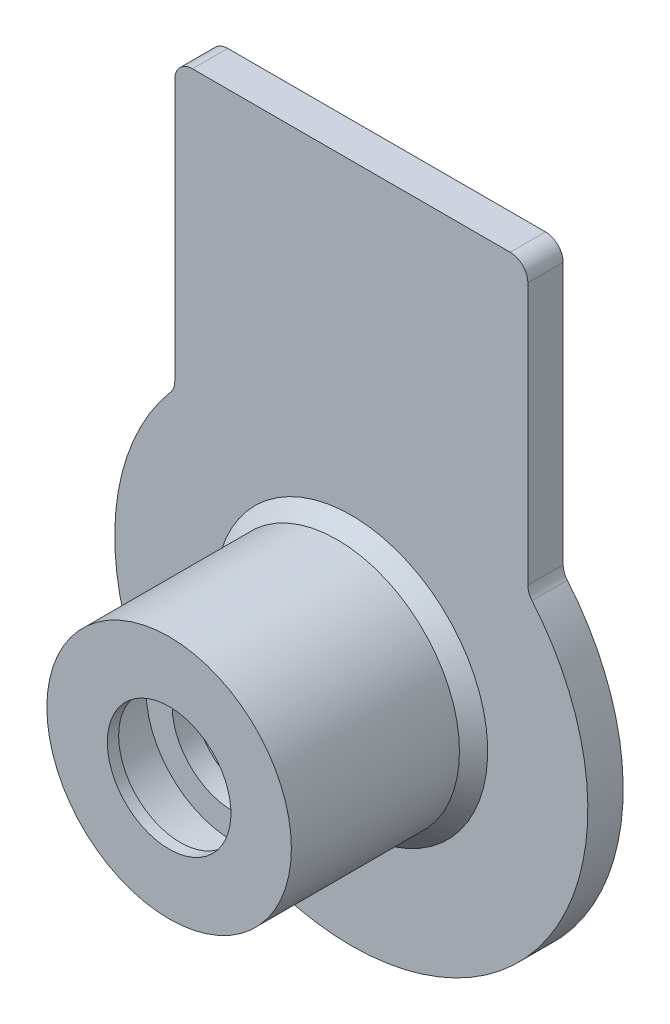
ISO-10303-21;
HEADER;
FILE_DESCRIPTION(('STEP AP214'),'2;1');
FILE_NAME('part.step','',(''),(''),'','','');
FILE_SCHEMA(('AUTOMOTIVE_DESIGN { 1 0 10303 214 1 1 1 1 }'));
ENDSEC;
DATA;
#1=APPLICATION_CONTEXT('core data for automotive mechanical design processes');
#2=APPLICATION_PROTOCOL_DEFINITION('international standard','automotive_design',2000,#1);
#3=PRODUCT_CONTEXT('',#1,'mechanical');
#4=PRODUCT('Part','Part','',(#3));
#5=PRODUCT_RELATED_PRODUCT_CATEGORY('part','',(#4));
#6=PRODUCT_DEFINITION_FORMATION('','',#4);
#7=PRODUCT_DEFINITION_CONTEXT('part definition',#1,'design');
#8=PRODUCT_DEFINITION('design','',#6,#7);
#9=PRODUCT_DEFINITION_SHAPE('','',#8);
#10=(LENGTH_UNIT() NAMED_UNIT(*) SI_UNIT(.MILLI.,.METRE.));
#11=(NAMED_UNIT(*) PLANE_ANGLE_UNIT() SI_UNIT($,.RADIAN.));
#12=(NAMED_UNIT(*) SI_UNIT($,.STERADIAN.) SOLID_ANGLE_UNIT());
#13=UNCERTAINTY_MEASURE_WITH_UNIT(LENGTH_MEASURE(1.E-05),#10,'distance_accuracy_value','');
#14=(GEOMETRIC_REPRESENTATION_CONTEXT(3) GLOBAL_UNCERTAINTY_ASSIGNED_CONTEXT((#13)) GLOBAL_UNIT_ASSIGNED_CONTEXT((#10,
#11,#12)) REPRESENTATION_CONTEXT('',''));
#15=CARTESIAN_POINT('',(0.,0.,0.));
#16=DIRECTION('',(0.,0.,1.));
#17=DIRECTION('',(1.,0.,0.));
#18=AXIS2_PLACEMENT_3D('',#15,#16,#17);
#19=CARTESIAN_POINT('',(-3.5,0.,12.32));
#20=DIRECTION('',(0.,0.,1.));
#21=DIRECTION('',(1.,0.,0.));
#22=AXIS2_PLACEMENT_3D('',#19,#20,#21);
#23=PLANE('',#22);
#24=CARTESIAN_POINT('',(0.,0.,12.32));
#25=DIRECTION('',(0.,0.,-1.));
#26=DIRECTION('',(-1.,0.,0.));
#27=AXIS2_PLACEMENT_3D('',#24,#25,#26);
#28=CIRCLE('',#27,3.5);
#29=CARTESIAN_POINT('',(-3.5,0.,12.32));
#30=VERTEX_POINT('',#29);
#31=EDGE_CURVE('E216',#30,#30,#28,.T.);
#32=ORIENTED_EDGE('',*,*,#31,.T.);
#33=EDGE_LOOP('',(#32));
#34=FACE_BOUND('',#33,.T.);
#35=CARTESIAN_POINT('',(0.,0.,12.32));
#36=DIRECTION('',(0.,0.,-1.));
#37=DIRECTION('',(-1.,0.,0.));
#38=AXIS2_PLACEMENT_3D('',#35,#36,#37);
#39=CIRCLE('',#38,6.925);
#40=CARTESIAN_POINT('',(-6.925,0.,12.32));
#41=VERTEX_POINT('',#40);
#42=EDGE_CURVE('E134',#41,#41,#39,.T.);
#43=ORIENTED_EDGE('',*,*,#42,.F.);
#44=EDGE_LOOP('',(#43));
#45=FACE_BOUND('',#44,.T.);
#46=ADVANCED_FACE('F40',(#34,#45),#23,.T.);
#47=CARTESIAN_POINT('',(0.,0.,0.));
#48=DIRECTION('',(0.,0.,-1.));
#49=DIRECTION('',(-1.,0.,0.));
#50=AXIS2_PLACEMENT_3D('',#47,#48,#49);
#51=CYLINDRICAL_SURFACE('',#50,6.925);
#52=CARTESIAN_POINT('',(0.,0.,2.8));
#53=DIRECTION('',(0.,0.,1.));
#54=DIRECTION('',(1.,0.,0.));
#55=AXIS2_PLACEMENT_3D('',#52,#53,#54);
#56=CIRCLE('',#55,6.925);
#57=CARTESIAN_POINT('',(-6.925,0.,2.8));
#58=VERTEX_POINT('',#57);
#59=EDGE_CURVE('E11',#58,#58,#56,.T.);
#60=ORIENTED_EDGE('',*,*,#59,.T.);
#61=EDGE_LOOP('',(#60));
#62=FACE_BOUND('',#61,.T.);
#63=ORIENTED_EDGE('',*,*,#42,.T.);
#64=EDGE_LOOP('',(#63));
#65=FACE_BOUND('',#64,.T.);
#66=ADVANCED_FACE('F178',(#62,#65),#51,.T.);
#67=CARTESIAN_POINT('',(-13.4,0.,2.));
#68=DIRECTION('',(0.,0.,1.));
#69=DIRECTION('',(1.,0.,0.));
#70=AXIS2_PLACEMENT_3D('',#67,#68,#69);
#71=PLANE('',#70);
#72=CARTESIAN_POINT('',(0.,0.,2.));
#73=DIRECTION('',(0.,0.,1.));
#74=DIRECTION('',(1.,0.,0.));
#75=AXIS2_PLACEMENT_3D('',#72,#73,#74);
#76=CIRCLE('',#75,7.725);
#77=CARTESIAN_POINT('',(-7.725,0.,2.));
#78=VERTEX_POINT('',#77);
#79=EDGE_CURVE('E49',#78,#78,#76,.F.);
#80=ORIENTED_EDGE('',*,*,#79,.T.);
#81=EDGE_LOOP('',(#80));
#82=FACE_BOUND('',#81,.T.);
#83=DIRECTION('',(0.,1.,0.));
#84=VECTOR('',#83,1.);
#85=CARTESIAN_POINT('',(10.,8.9196412483911,2.));
#86=LINE('',#85,#84);
#87=CARTESIAN_POINT('',(10.,9.29300812439116,2.));
#88=VERTEX_POINT('',#87);
#89=CARTESIAN_POINT('',(10.,24.1215762016988,2.));
#90=VERTEX_POINT('',#89);
#91=EDGE_CURVE('E211',#88,#90,#86,.T.);
#92=ORIENTED_EDGE('',*,*,#91,.T.);
#93=CARTESIAN_POINT('',(9.,24.1215762016988,2.));
#94=DIRECTION('',(0.,0.,1.));
#95=DIRECTION('',(1.,0.,0.));
#96=AXIS2_PLACEMENT_3D('',#93,#94,#95);
#97=CIRCLE('',#96,1.);
#98=CARTESIAN_POINT('',(9.,25.1215762016988,2.));
#99=VERTEX_POINT('',#98);
#100=EDGE_CURVE('E148',#90,#99,#97,.T.);
#101=ORIENTED_EDGE('',*,*,#100,.T.);
#102=DIRECTION('',(-1.,0.,0.));
#103=VECTOR('',#102,1.);
#104=CARTESIAN_POINT('',(10.,25.1215762016988,2.));
#105=LINE('',#104,#103);
#106=CARTESIAN_POINT('',(-9.,25.1215762016988,2.));
#107=VERTEX_POINT('',#106);
#108=EDGE_CURVE('E206',#99,#107,#105,.T.);
#109=ORIENTED_EDGE('',*,*,#108,.T.);
#110=CARTESIAN_POINT('',(-9.,24.1215762016988,2.));
#111=DIRECTION('',(0.,0.,1.));
#112=DIRECTION('',(1.,0.,0.));
#113=AXIS2_PLACEMENT_3D('',#110,#111,#112);
#114=CIRCLE('',#113,1.);
#115=CARTESIAN_POINT('',(-10.,24.1215762016988,2.));
#116=VERTEX_POINT('',#115);
#117=EDGE_CURVE('E146',#107,#116,#114,.T.);
#118=ORIENTED_EDGE('',*,*,#117,.T.);
#119=DIRECTION('',(0.,-1.,0.));
#120=VECTOR('',#119,1.);
#121=CARTESIAN_POINT('',(-10.,25.1215762016988,2.));
#122=LINE('',#121,#120);
#123=CARTESIAN_POINT('',(-10.,9.29300812439116,2.));
#124=VERTEX_POINT('',#123);
#125=EDGE_CURVE('E202',#116,#124,#122,.T.);
#126=ORIENTED_EDGE('',*,*,#125,.T.);
#127=CARTESIAN_POINT('',(-11.,9.29300812439116,2.));
#128=DIRECTION('',(0.,0.,1.));
#129=DIRECTION('',(1.,0.,0.));
#130=AXIS2_PLACEMENT_3D('',#127,#128,#129);
#131=CIRCLE('',#130,1.);
#132=CARTESIAN_POINT('',(-10.2361111111111,8.6476603379751,2.));
#133=VERTEX_POINT('',#132);
#134=EDGE_CURVE('E133',#124,#133,#131,.F.);
#135=ORIENTED_EDGE('',*,*,#134,.T.);
#136=CARTESIAN_POINT('',(0.,0.,2.));
#137=DIRECTION('',(0.,0.,-1.));
#138=DIRECTION('',(-1.,0.,0.));
#139=AXIS2_PLACEMENT_3D('',#136,#137,#138);
#140=CIRCLE('',#139,13.4);
#141=CARTESIAN_POINT('',(10.2361111111111,8.6476603379751,2.));
#142=VERTEX_POINT('',#141);
#143=EDGE_CURVE('E125',#142,#133,#140,.T.);
#144=ORIENTED_EDGE('',*,*,#143,.F.);
#145=CARTESIAN_POINT('',(11.,9.29300812439116,2.));
#146=DIRECTION('',(0.,0.,1.));
#147=DIRECTION('',(1.,0.,0.));
#148=AXIS2_PLACEMENT_3D('',#145,#146,#147);
#149=CIRCLE('',#148,1.);
#150=EDGE_CURVE('E108',#142,#88,#149,.F.);
#151=ORIENTED_EDGE('',*,*,#150,.T.);
#152=EDGE_LOOP('',(#92,#101,#109,#118,#126,#135,#144,#151));
#153=FACE_BOUND('',#152,.T.);
#154=ADVANCED_FACE('F131',(#82,#153),#71,.T.);
#155=CARTESIAN_POINT('',(0.,0.,0.));
#156=DIRECTION('',(0.,0.,-1.));
#157=DIRECTION('',(-1.,0.,0.));
#158=AXIS2_PLACEMENT_3D('',#155,#156,#157);
#159=CYLINDRICAL_SURFACE('',#158,13.4);
#160=CARTESIAN_POINT('',(0.,0.,0.));
#161=DIRECTION('',(0.,0.,-1.));
#162=DIRECTION('',(-1.,0.,0.));
#163=AXIS2_PLACEMENT_3D('',#160,#161,#162);
#164=CIRCLE('',#163,13.4);
#165=CARTESIAN_POINT('',(10.2361111111111,8.6476603379751,0.));
#166=VERTEX_POINT('',#165);
#167=CARTESIAN_POINT('',(-10.2361111111111,8.6476603379751,0.));
#168=VERTEX_POINT('',#167);
#169=EDGE_CURVE('E127',#166,#168,#164,.T.);
#170=ORIENTED_EDGE('',*,*,#169,.F.);
#171=DIRECTION('',(0.,0.,-1.));
#172=VECTOR('',#171,1.);
#173=CARTESIAN_POINT('',(10.2361111111111,8.6476603379751,0.));
#174=LINE('',#173,#172);
#175=EDGE_CURVE('E112',#166,#142,#174,.F.);
#176=ORIENTED_EDGE('',*,*,#175,.T.);
#177=ORIENTED_EDGE('',*,*,#143,.T.);
#178=DIRECTION('',(0.,0.,-1.));
#179=VECTOR('',#178,1.);
#180=CARTESIAN_POINT('',(-10.2361111111111,8.64766033797511,0.));
#181=LINE('',#180,#179);
#182=EDGE_CURVE('E129',#133,#168,#181,.T.);
#183=ORIENTED_EDGE('',*,*,#182,.T.);
#184=EDGE_LOOP('',(#170,#176,#177,#183));
#185=FACE_BOUND('',#184,.T.);
#186=ADVANCED_FACE('F124',(#185),#159,.T.);
#187=CARTESIAN_POINT('',(-5.,0.,0.));
#188=DIRECTION('',(0.,0.,-1.));
#189=DIRECTION('',(-1.,0.,0.));
#190=AXIS2_PLACEMENT_3D('',#187,#188,#189);
#191=PLANE('',#190);
#192=DIRECTION('',(-1.,0.,0.));
#193=VECTOR('',#192,1.);
#194=CARTESIAN_POINT('',(10.,25.1215762016988,0.));
#195=LINE('',#194,#193);
#196=CARTESIAN_POINT('',(9.,25.1215762016988,0.));
#197=VERTEX_POINT('',#196);
#198=CARTESIAN_POINT('',(-9.,25.1215762016988,0.));
#199=VERTEX_POINT('',#198);
#200=EDGE_CURVE('E209',#197,#199,#195,.T.);
#201=ORIENTED_EDGE('',*,*,#200,.F.);
#202=CARTESIAN_POINT('',(9.,24.1215762016988,0.));
#203=DIRECTION('',(0.,0.,-1.));
#204=DIRECTION('',(-1.,0.,0.));
#205=AXIS2_PLACEMENT_3D('',#202,#203,#204);
#206=CIRCLE('',#205,1.);
#207=CARTESIAN_POINT('',(10.,24.1215762016988,0.));
#208=VERTEX_POINT('',#207);
#209=EDGE_CURVE('E157',#197,#208,#206,.T.);
#210=ORIENTED_EDGE('',*,*,#209,.T.);
#211=DIRECTION('',(0.,1.,0.));
#212=VECTOR('',#211,1.);
#213=CARTESIAN_POINT('',(10.,8.9196412483911,0.));
#214=LINE('',#213,#212);
#215=CARTESIAN_POINT('',(10.,9.29300812439116,0.));
#216=VERTEX_POINT('',#215);
#217=EDGE_CURVE('E205',#216,#208,#214,.T.);
#218=ORIENTED_EDGE('',*,*,#217,.F.);
#219=CARTESIAN_POINT('',(11.,9.29300812439116,0.));
#220=DIRECTION('',(0.,0.,-1.));
#221=DIRECTION('',(-1.,0.,0.));
#222=AXIS2_PLACEMENT_3D('',#219,#220,#221);
#223=CIRCLE('',#222,1.);
#224=EDGE_CURVE('E118',#216,#166,#223,.F.);
#225=ORIENTED_EDGE('',*,*,#224,.T.);
#226=ORIENTED_EDGE('',*,*,#169,.T.);
#227=CARTESIAN_POINT('',(-11.,9.29300812439116,0.));
#228=DIRECTION('',(0.,0.,-1.));
#229=DIRECTION('',(-1.,0.,0.));
#230=AXIS2_PLACEMENT_3D('',#227,#228,#229);
#231=CIRCLE('',#230,1.);
#232=CARTESIAN_POINT('',(-10.,9.29300812439116,0.));
#233=VERTEX_POINT('',#232);
#234=EDGE_CURVE('E56',#168,#233,#231,.F.);
#235=ORIENTED_EDGE('',*,*,#234,.T.);
#236=DIRECTION('',(0.,-1.,0.));
#237=VECTOR('',#236,1.);
#238=CARTESIAN_POINT('',(-10.,25.1215762016988,0.));
#239=LINE('',#238,#237);
#240=CARTESIAN_POINT('',(-10.,24.1215762016988,0.));
#241=VERTEX_POINT('',#240);
#242=EDGE_CURVE('E203',#241,#233,#239,.T.);
#243=ORIENTED_EDGE('',*,*,#242,.F.);
#244=CARTESIAN_POINT('',(-9.,24.1215762016988,0.));
#245=DIRECTION('',(0.,0.,-1.));
#246=DIRECTION('',(-1.,0.,0.));
#247=AXIS2_PLACEMENT_3D('',#244,#245,#246);
#248=CIRCLE('',#247,1.);
#249=EDGE_CURVE('E155',#241,#199,#248,.T.);
#250=ORIENTED_EDGE('',*,*,#249,.T.);
#251=EDGE_LOOP('',(#201,#210,#218,#225,#226,#235,#243,#250));
#252=FACE_BOUND('',#251,.T.);
#253=CARTESIAN_POINT('',(0.,0.,0.));
#254=DIRECTION('',(0.,0.,-1.));
#255=DIRECTION('',(-1.,0.,0.));
#256=AXIS2_PLACEMENT_3D('',#253,#254,#255);
#257=CIRCLE('',#256,5.);
#258=CARTESIAN_POINT('',(-5.,0.,0.));
#259=VERTEX_POINT('',#258);
#260=EDGE_CURVE('E138',#259,#259,#257,.T.);
#261=ORIENTED_EDGE('',*,*,#260,.F.);
#262=EDGE_LOOP('',(#261));
#263=FACE_BOUND('',#262,.T.);
#264=ADVANCED_FACE('F243',(#252,#263),#191,.T.);
#265=CARTESIAN_POINT('',(0.,0.,0.));
#266=DIRECTION('',(0.,0.,-1.));
#267=DIRECTION('',(-1.,0.,0.));
#268=AXIS2_PLACEMENT_3D('',#265,#266,#267);
#269=CYLINDRICAL_SURFACE('',#268,5.);
#270=ORIENTED_EDGE('',*,*,#260,.T.);
#271=EDGE_LOOP('',(#270));
#272=FACE_BOUND('',#271,.T.);
#273=CARTESIAN_POINT('',(0.,0.,7.5));
#274=DIRECTION('',(0.,0.,-1.));
#275=DIRECTION('',(-1.,0.,0.));
#276=AXIS2_PLACEMENT_3D('',#273,#274,#275);
#277=CIRCLE('',#276,5.);
#278=CARTESIAN_POINT('',(-5.,0.,7.5));
#279=VERTEX_POINT('',#278);
#280=EDGE_CURVE('E235',#279,#279,#277,.T.);
#281=ORIENTED_EDGE('',*,*,#280,.F.);
#282=EDGE_LOOP('',(#281));
#283=FACE_BOUND('',#282,.T.);
#284=ADVANCED_FACE('F240',(#272,#283),#269,.F.);
#285=CARTESIAN_POINT('',(-3.45,0.,7.5));
#286=DIRECTION('',(0.,0.,-1.));
#287=DIRECTION('',(-1.,0.,0.));
#288=AXIS2_PLACEMENT_3D('',#285,#286,#287);
#289=PLANE('',#288);
#290=ORIENTED_EDGE('',*,*,#280,.T.);
#291=EDGE_LOOP('',(#290));
#292=FACE_BOUND('',#291,.T.);
#293=CARTESIAN_POINT('',(0.,0.,7.5));
#294=DIRECTION('',(0.,0.,-1.));
#295=DIRECTION('',(-1.,0.,0.));
#296=AXIS2_PLACEMENT_3D('',#293,#294,#295);
#297=CIRCLE('',#296,3.45);
#298=CARTESIAN_POINT('',(-3.45,0.,7.5));
#299=VERTEX_POINT('',#298);
#300=EDGE_CURVE('E232',#299,#299,#297,.T.);
#301=ORIENTED_EDGE('',*,*,#300,.F.);
#302=EDGE_LOOP('',(#301));
#303=FACE_BOUND('',#302,.T.);
#304=ADVANCED_FACE('F250',(#292,#303),#289,.T.);
#305=CARTESIAN_POINT('',(0.,0.,0.));
#306=DIRECTION('',(0.,0.,-1.));
#307=DIRECTION('',(-1.,0.,0.));
#308=AXIS2_PLACEMENT_3D('',#305,#306,#307);
#309=CYLINDRICAL_SURFACE('',#308,3.45);
#310=ORIENTED_EDGE('',*,*,#300,.T.);
#311=EDGE_LOOP('',(#310));
#312=FACE_BOUND('',#311,.T.);
#313=CARTESIAN_POINT('',(0.,0.,8.7));
#314=DIRECTION('',(0.,0.,-1.));
#315=DIRECTION('',(-1.,0.,0.));
#316=AXIS2_PLACEMENT_3D('',#313,#314,#315);
#317=CIRCLE('',#316,3.45);
#318=CARTESIAN_POINT('',(-3.45,0.,8.7));
#319=VERTEX_POINT('',#318);
#320=EDGE_CURVE('E229',#319,#319,#317,.T.);
#321=ORIENTED_EDGE('',*,*,#320,.F.);
#322=EDGE_LOOP('',(#321));
#323=FACE_BOUND('',#322,.T.);
#324=ADVANCED_FACE('F390',(#312,#323),#309,.F.);
#325=CARTESIAN_POINT('',(-4.925,0.,8.7));
#326=DIRECTION('',(0.,0.,1.));
#327=DIRECTION('',(1.,0.,0.));
#328=AXIS2_PLACEMENT_3D('',#325,#326,#327);
#329=PLANE('',#328);
#330=ORIENTED_EDGE('',*,*,#320,.T.);
#331=EDGE_LOOP('',(#330));
#332=FACE_BOUND('',#331,.T.);
#333=CARTESIAN_POINT('',(0.,0.,8.7));
#334=DIRECTION('',(0.,0.,-1.));
#335=DIRECTION('',(-1.,0.,0.));
#336=AXIS2_PLACEMENT_3D('',#333,#334,#335);
#337=CIRCLE('',#336,4.925);
#338=CARTESIAN_POINT('',(-4.925,0.,8.7));
#339=VERTEX_POINT('',#338);
#340=EDGE_CURVE('E226',#339,#339,#337,.T.);
#341=ORIENTED_EDGE('',*,*,#340,.F.);
#342=EDGE_LOOP('',(#341));
#343=FACE_BOUND('',#342,.T.);
#344=ADVANCED_FACE('F379',(#332,#343),#329,.T.);
#345=CARTESIAN_POINT('',(0.,0.,0.));
#346=DIRECTION('',(0.,0.,-1.));
#347=DIRECTION('',(-1.,0.,0.));
#348=AXIS2_PLACEMENT_3D('',#345,#346,#347);
#349=CYLINDRICAL_SURFACE('',#348,4.925);
#350=ORIENTED_EDGE('',*,*,#340,.T.);
#351=EDGE_LOOP('',(#350));
#352=FACE_BOUND('',#351,.T.);
#353=CARTESIAN_POINT('',(0.,0.,11.2));
#354=DIRECTION('',(0.,0.,-1.));
#355=DIRECTION('',(-1.,0.,0.));
#356=AXIS2_PLACEMENT_3D('',#353,#354,#355);
#357=CIRCLE('',#356,4.925);
#358=CARTESIAN_POINT('',(-4.925,0.,11.2));
#359=VERTEX_POINT('',#358);
#360=EDGE_CURVE('E223',#359,#359,#357,.T.);
#361=ORIENTED_EDGE('',*,*,#360,.F.);
#362=EDGE_LOOP('',(#361));
#363=FACE_BOUND('',#362,.T.);
#364=ADVANCED_FACE('F368',(#352,#363),#349,.F.);
#365=CARTESIAN_POINT('',(0.,0.,11.68));
#366=DIRECTION('',(0.,0.,-1.));
#367=DIRECTION('',(-1.,0.,0.));
#368=AXIS2_PLACEMENT_3D('',#365,#366,#367);
#369=CONICAL_SURFACE('',#368,3.5,1.24589120872978);
#370=ORIENTED_EDGE('',*,*,#360,.T.);
#371=EDGE_LOOP('',(#370));
#372=FACE_BOUND('',#371,.T.);
#373=CARTESIAN_POINT('',(0.,0.,11.68));
#374=DIRECTION('',(0.,0.,-1.));
#375=DIRECTION('',(-1.,0.,0.));
#376=AXIS2_PLACEMENT_3D('',#373,#374,#375);
#377=CIRCLE('',#376,3.5);
#378=CARTESIAN_POINT('',(-3.5,0.,11.68));
#379=VERTEX_POINT('',#378);
#380=EDGE_CURVE('E220',#379,#379,#377,.T.);
#381=ORIENTED_EDGE('',*,*,#380,.F.);
#382=EDGE_LOOP('',(#381));
#383=FACE_BOUND('',#382,.T.);
#384=ADVANCED_FACE('F359',(#372,#383),#369,.F.);
#385=CARTESIAN_POINT('',(0.,0.,0.));
#386=DIRECTION('',(0.,0.,-1.));
#387=DIRECTION('',(-1.,0.,0.));
#388=AXIS2_PLACEMENT_3D('',#385,#386,#387);
#389=CYLINDRICAL_SURFACE('',#388,3.5);
#390=ORIENTED_EDGE('',*,*,#380,.T.);
#391=EDGE_LOOP('',(#390));
#392=FACE_BOUND('',#391,.T.);
#393=ORIENTED_EDGE('',*,*,#31,.F.);
#394=EDGE_LOOP('',(#393));
#395=FACE_BOUND('',#394,.T.);
#396=ADVANCED_FACE('F272',(#392,#395),#389,.F.);
#397=CARTESIAN_POINT('',(10.,8.9196412483911,-25.7391277286394));
#398=DIRECTION('',(1.,0.,0.));
#399=DIRECTION('',(0.,1.,0.));
#400=AXIS2_PLACEMENT_3D('',#397,#398,#399);
#401=PLANE('',#400);
#402=ORIENTED_EDGE('',*,*,#91,.F.);
#403=DIRECTION('',(0.,0.,1.));
#404=VECTOR('',#403,1.);
#405=CARTESIAN_POINT('',(10.,9.29300812439116,0.));
#406=LINE('',#405,#404);
#407=EDGE_CURVE('E113',#88,#216,#406,.F.);
#408=ORIENTED_EDGE('',*,*,#407,.T.);
#409=ORIENTED_EDGE('',*,*,#217,.T.);
#410=DIRECTION('',(0.,0.,1.));
#411=VECTOR('',#410,1.);
#412=CARTESIAN_POINT('',(10.,24.1215762016988,-25.7391277286394));
#413=LINE('',#412,#411);
#414=EDGE_CURVE('E128',#208,#90,#413,.T.);
#415=ORIENTED_EDGE('',*,*,#414,.T.);
#416=EDGE_LOOP('',(#402,#408,#409,#415));
#417=FACE_BOUND('',#416,.T.);
#418=ADVANCED_FACE('F283',(#417),#401,.T.);
#419=CARTESIAN_POINT('',(10.,25.1215762016988,-25.7391277286394));
#420=DIRECTION('',(0.,1.,0.));
#421=DIRECTION('',(0.,0.,1.));
#422=AXIS2_PLACEMENT_3D('',#419,#420,#421);
#423=PLANE('',#422);
#424=ORIENTED_EDGE('',*,*,#108,.F.);
#425=DIRECTION('',(0.,0.,1.));
#426=VECTOR('',#425,1.);
#427=CARTESIAN_POINT('',(9.,25.1215762016988,-25.7391277286394));
#428=LINE('',#427,#426);
#429=EDGE_CURVE('E153',#99,#197,#428,.F.);
#430=ORIENTED_EDGE('',*,*,#429,.T.);
#431=ORIENTED_EDGE('',*,*,#200,.T.);
#432=DIRECTION('',(0.,0.,1.));
#433=VECTOR('',#432,1.);
#434=CARTESIAN_POINT('',(-9.,25.1215762016988,-25.7391277286394));
#435=LINE('',#434,#433);
#436=EDGE_CURVE('E150',#199,#107,#435,.T.);
#437=ORIENTED_EDGE('',*,*,#436,.T.);
#438=EDGE_LOOP('',(#424,#430,#431,#437));
#439=FACE_BOUND('',#438,.T.);
#440=ADVANCED_FACE('F287',(#439),#423,.T.);
#441=CARTESIAN_POINT('',(-10.,25.1215762016988,-25.7391277286394));
#442=DIRECTION('',(-1.,0.,0.));
#443=DIRECTION('',(0.,-1.,0.));
#444=AXIS2_PLACEMENT_3D('',#441,#442,#443);
#445=PLANE('',#444);
#446=ORIENTED_EDGE('',*,*,#242,.T.);
#447=DIRECTION('',(0.,0.,1.));
#448=VECTOR('',#447,1.);
#449=CARTESIAN_POINT('',(-10.,9.29300812439116,2.));
#450=LINE('',#449,#448);
#451=EDGE_CURVE('E119',#233,#124,#450,.T.);
#452=ORIENTED_EDGE('',*,*,#451,.T.);
#453=ORIENTED_EDGE('',*,*,#125,.F.);
#454=DIRECTION('',(0.,0.,1.));
#455=VECTOR('',#454,1.);
#456=CARTESIAN_POINT('',(-10.,24.1215762016988,-25.7391277286394));
#457=LINE('',#456,#455);
#458=EDGE_CURVE('E63',#116,#241,#457,.F.);
#459=ORIENTED_EDGE('',*,*,#458,.T.);
#460=EDGE_LOOP('',(#446,#452,#453,#459));
#461=FACE_BOUND('',#460,.T.);
#462=ADVANCED_FACE('F193',(#461),#445,.T.);
#463=CARTESIAN_POINT('',(11.,9.29300812439116,0.));
#464=DIRECTION('',(0.,0.,-1.));
#465=DIRECTION('',(-1.,0.,0.));
#466=AXIS2_PLACEMENT_3D('',#463,#464,#465);
#467=CYLINDRICAL_SURFACE('',#466,1.);
#468=ORIENTED_EDGE('',*,*,#224,.F.);
#469=ORIENTED_EDGE('',*,*,#407,.F.);
#470=ORIENTED_EDGE('',*,*,#150,.F.);
#471=ORIENTED_EDGE('',*,*,#175,.F.);
#472=EDGE_LOOP('',(#468,#469,#470,#471));
#473=FACE_BOUND('',#472,.T.);
#474=ADVANCED_FACE('F111',(#473),#467,.F.);
#475=CARTESIAN_POINT('',(9.,24.1215762016988,-25.7391277286394));
#476=DIRECTION('',(0.,0.,1.));
#477=DIRECTION('',(1.,0.,0.));
#478=AXIS2_PLACEMENT_3D('',#475,#476,#477);
#479=CYLINDRICAL_SURFACE('',#478,1.);
#480=ORIENTED_EDGE('',*,*,#209,.F.);
#481=ORIENTED_EDGE('',*,*,#429,.F.);
#482=ORIENTED_EDGE('',*,*,#100,.F.);
#483=ORIENTED_EDGE('',*,*,#414,.F.);
#484=EDGE_LOOP('',(#480,#481,#482,#483));
#485=FACE_BOUND('',#484,.T.);
#486=ADVANCED_FACE('F192',(#485),#479,.T.);
#487=CARTESIAN_POINT('',(-11.,9.29300812439116,0.));
#488=DIRECTION('',(0.,0.,-1.));
#489=DIRECTION('',(-1.,0.,0.));
#490=AXIS2_PLACEMENT_3D('',#487,#488,#489);
#491=CYLINDRICAL_SURFACE('',#490,1.);
#492=ORIENTED_EDGE('',*,*,#234,.F.);
#493=ORIENTED_EDGE('',*,*,#182,.F.);
#494=ORIENTED_EDGE('',*,*,#134,.F.);
#495=ORIENTED_EDGE('',*,*,#451,.F.);
#496=EDGE_LOOP('',(#492,#493,#494,#495));
#497=FACE_BOUND('',#496,.T.);
#498=ADVANCED_FACE('F174',(#497),#491,.F.);
#499=CARTESIAN_POINT('',(-9.,24.1215762016988,-25.7391277286394));
#500=DIRECTION('',(0.,0.,1.));
#501=DIRECTION('',(1.,0.,0.));
#502=AXIS2_PLACEMENT_3D('',#499,#500,#501);
#503=CYLINDRICAL_SURFACE('',#502,1.);
#504=ORIENTED_EDGE('',*,*,#249,.F.);
#505=ORIENTED_EDGE('',*,*,#458,.F.);
#506=ORIENTED_EDGE('',*,*,#117,.F.);
#507=ORIENTED_EDGE('',*,*,#436,.F.);
#508=EDGE_LOOP('',(#504,#505,#506,#507));
#509=FACE_BOUND('',#508,.T.);
#510=ADVANCED_FACE('F169',(#509),#503,.T.);
#511=CARTESIAN_POINT('',(0.,0.,2.));
#512=DIRECTION('',(0.,0.,-1.));
#513=DIRECTION('',(-1.,0.,0.));
#514=AXIS2_PLACEMENT_3D('',#511,#512,#513);
#515=CONICAL_SURFACE('',#514,7.725,0.785398163397453);
#516=CARTESIAN_POINT('',(-6.925,0.,2.8));
#517=CARTESIAN_POINT('',(-6.93333333333333,0.,2.79166666666667));
#518=CARTESIAN_POINT('',(-6.94166666666667,0.,2.78333333333333));
#519=CARTESIAN_POINT('',(-6.95833333333333,0.,2.76666666666667));
#520=CARTESIAN_POINT('',(-6.96666666666667,0.,2.75833333333333));
#521=CARTESIAN_POINT('',(-6.98333333333333,0.,2.74166666666667));
#522=CARTESIAN_POINT('',(-6.99166666666667,0.,2.73333333333333));
#523=CARTESIAN_POINT('',(-7.00833333333333,0.,2.71666666666667));
#524=CARTESIAN_POINT('',(-7.01666666666667,0.,2.70833333333333));
#525=CARTESIAN_POINT('',(-7.03333333333333,0.,2.69166666666667));
#526=CARTESIAN_POINT('',(-7.04166666666667,0.,2.68333333333333));
#527=CARTESIAN_POINT('',(-7.05833333333333,0.,2.66666666666667));
#528=CARTESIAN_POINT('',(-7.06666666666667,0.,2.65833333333333));
#529=CARTESIAN_POINT('',(-7.08333333333333,0.,2.64166666666667));
#530=CARTESIAN_POINT('',(-7.09166666666667,0.,2.63333333333333));
#531=CARTESIAN_POINT('',(-7.10833333333333,0.,2.61666666666667));
#532=CARTESIAN_POINT('',(-7.11666666666667,0.,2.60833333333333));
#533=CARTESIAN_POINT('',(-7.13333333333333,0.,2.59166666666667));
#534=CARTESIAN_POINT('',(-7.14166666666667,0.,2.58333333333333));
#535=CARTESIAN_POINT('',(-7.15833333333333,0.,2.56666666666667));
#536=CARTESIAN_POINT('',(-7.16666666666667,0.,2.55833333333333));
#537=CARTESIAN_POINT('',(-7.18333333333333,0.,2.54166666666667));
#538=CARTESIAN_POINT('',(-7.19166666666667,0.,2.53333333333333));
#539=CARTESIAN_POINT('',(-7.20833333333333,0.,2.51666666666667));
#540=CARTESIAN_POINT('',(-7.21666666666667,0.,2.50833333333333));
#541=CARTESIAN_POINT('',(-7.23333333333333,0.,2.49166666666667));
#542=CARTESIAN_POINT('',(-7.24166666666667,0.,2.48333333333333));
#543=CARTESIAN_POINT('',(-7.25833333333333,0.,2.46666666666667));
#544=CARTESIAN_POINT('',(-7.26666666666667,0.,2.45833333333333));
#545=CARTESIAN_POINT('',(-7.28333333333333,0.,2.44166666666667));
#546=CARTESIAN_POINT('',(-7.29166666666667,0.,2.43333333333333));
#547=CARTESIAN_POINT('',(-7.30833333333333,0.,2.41666666666667));
#548=CARTESIAN_POINT('',(-7.31666666666667,0.,2.40833333333333));
#549=CARTESIAN_POINT('',(-7.33333333333333,0.,2.39166666666667));
#550=CARTESIAN_POINT('',(-7.34166666666667,0.,2.38333333333333));
#551=CARTESIAN_POINT('',(-7.35833333333334,0.,2.36666666666667));
#552=CARTESIAN_POINT('',(-7.36666666666667,0.,2.35833333333333));
#553=CARTESIAN_POINT('',(-7.38333333333334,0.,2.34166666666667));
#554=CARTESIAN_POINT('',(-7.39166666666667,0.,2.33333333333333));
#555=CARTESIAN_POINT('',(-7.40833333333333,0.,2.31666666666667));
#556=CARTESIAN_POINT('',(-7.41666666666667,0.,2.30833333333333));
#557=CARTESIAN_POINT('',(-7.43333333333334,0.,2.29166666666667));
#558=CARTESIAN_POINT('',(-7.44166666666667,0.,2.28333333333333));
#559=CARTESIAN_POINT('',(-7.45833333333334,0.,2.26666666666667));
#560=CARTESIAN_POINT('',(-7.46666666666667,0.,2.25833333333333));
#561=CARTESIAN_POINT('',(-7.48333333333334,0.,2.24166666666667));
#562=CARTESIAN_POINT('',(-7.49166666666667,0.,2.23333333333333));
#563=CARTESIAN_POINT('',(-7.50833333333334,0.,2.21666666666667));
#564=CARTESIAN_POINT('',(-7.51666666666667,0.,2.20833333333333));
#565=CARTESIAN_POINT('',(-7.53333333333334,0.,2.19166666666667));
#566=CARTESIAN_POINT('',(-7.54166666666667,0.,2.18333333333333));
#567=CARTESIAN_POINT('',(-7.55833333333334,0.,2.16666666666667));
#568=CARTESIAN_POINT('',(-7.56666666666667,0.,2.15833333333333));
#569=CARTESIAN_POINT('',(-7.58333333333334,0.,2.14166666666667));
#570=CARTESIAN_POINT('',(-7.59166666666667,0.,2.13333333333333));
#571=CARTESIAN_POINT('',(-7.60833333333334,0.,2.11666666666667));
#572=CARTESIAN_POINT('',(-7.61666666666667,0.,2.10833333333333));
#573=CARTESIAN_POINT('',(-7.63333333333334,0.,2.09166666666667));
#574=CARTESIAN_POINT('',(-7.64166666666667,0.,2.08333333333333));
#575=CARTESIAN_POINT('',(-7.65833333333334,0.,2.06666666666667));
#576=CARTESIAN_POINT('',(-7.66666666666667,0.,2.05833333333333));
#577=CARTESIAN_POINT('',(-7.68333333333334,0.,2.04166666666667));
#578=CARTESIAN_POINT('',(-7.69166666666667,0.,2.03333333333333));
#579=CARTESIAN_POINT('',(-7.70833333333334,0.,2.01666666666667));
#580=CARTESIAN_POINT('',(-7.71666666666667,0.,2.00833333333333));
#581=CARTESIAN_POINT('',(-7.725,0.,2.));
#582=B_SPLINE_CURVE_WITH_KNOTS('',3,(#516,#517,#518,#519,#520,#521,#522,#523,#524,#525,#526,
#527,#528,#529,#530,#531,#532,#533,#534,#535,#536,#537,#538,#539,#540,#541,#542,#543,#544,#545,
#546,#547,#548,#549,#550,#551,#552,#553,#554,#555,#556,#557,#558,#559,#560,#561,#562,#563,#564,
#565,#566,#567,#568,#569,#570,#571,#572,#573,#574,#575,#576,#577,#578,#579,#580,#581),
.UNSPECIFIED.,.F.,.F.,(4,2,2,2,2,2,2,2,2,2,2,2,2,2,2,2,2,2,2,2,2,2,2,2,2,2,2,2,2,2,2,2,4),(0.,
0.0353553390593275,0.0707106781186553,0.106066017177982,0.14142135623731,0.176776695296637,
0.212132034355965,0.247487373415292,0.28284271247462,0.318198051533947,0.353553390593275,
0.388908729652602,0.424264068711929,0.459619407771257,0.494974746830584,0.530330085889912,
0.565685424949239,0.601040764008567,0.636396103067894,0.671751442127222,0.707106781186549,
0.742462120245877,0.777817459305204,0.813172798364531,0.848528137423859,0.883883476483186,
0.919238815542514,0.954594154601841,0.989949493661169,1.0253048327205,1.06066017177982,
1.09601551083915,1.13137084989848),.UNSPECIFIED.);
#583=EDGE_CURVE('BSEAM43',#58,#78,#582,.T.);
#584=ORIENTED_EDGE('',*,*,#59,.F.);
#585=ORIENTED_EDGE('',*,*,#79,.F.);
#586=ORIENTED_EDGE('',*,*,#583,.T.);
#587=ORIENTED_EDGE('',*,*,#583,.F.);
#588=EDGE_LOOP('',(#584,#586,#585,#587));
#589=FACE_BOUND('',#588,.T.);
#590=ADVANCED_FACE('F43',(#589),#515,.T.);
#591=CLOSED_SHELL('',(#46,#66,#154,#186,#264,#284,#304,#324,#344,#364,#384,#396,#418,#440,#462,
#474,#486,#498,#510,#590));
#592=MANIFOLD_SOLID_BREP('B2',#591);
#593=ADVANCED_BREP_SHAPE_REPRESENTATION('',(#18,#592),#14);
#594=SHAPE_DEFINITION_REPRESENTATION(#9,#593);
ENDSEC;
END-ISO-10303-21;
